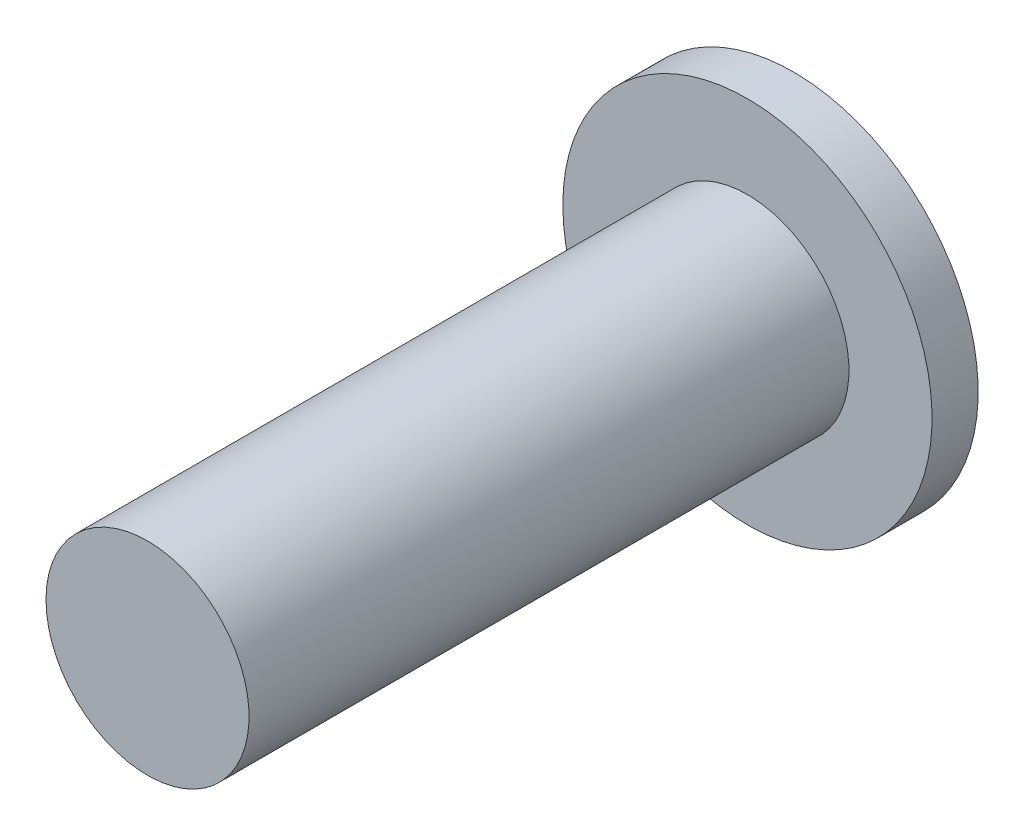
ISO-10303-21;
HEADER;
FILE_DESCRIPTION(('STEP AP214'),'2;1');
FILE_NAME('part.step','',(''),(''),'','','');
FILE_SCHEMA(('AUTOMOTIVE_DESIGN { 1 0 10303 214 1 1 1 1 }'));
ENDSEC;
DATA;
#1=APPLICATION_CONTEXT('core data for automotive mechanical design processes');
#2=APPLICATION_PROTOCOL_DEFINITION('international standard','automotive_design',2000,#1);
#3=PRODUCT_CONTEXT('',#1,'mechanical');
#4=PRODUCT('Part','Part','',(#3));
#5=PRODUCT_RELATED_PRODUCT_CATEGORY('part','',(#4));
#6=PRODUCT_DEFINITION_FORMATION('','',#4);
#7=PRODUCT_DEFINITION_CONTEXT('part definition',#1,'design');
#8=PRODUCT_DEFINITION('design','',#6,#7);
#9=PRODUCT_DEFINITION_SHAPE('','',#8);
#10=(LENGTH_UNIT() NAMED_UNIT(*) SI_UNIT(.MILLI.,.METRE.));
#11=(NAMED_UNIT(*) PLANE_ANGLE_UNIT() SI_UNIT($,.RADIAN.));
#12=(NAMED_UNIT(*) SI_UNIT($,.STERADIAN.) SOLID_ANGLE_UNIT());
#13=UNCERTAINTY_MEASURE_WITH_UNIT(LENGTH_MEASURE(1.E-05),#10,'distance_accuracy_value','');
#14=(GEOMETRIC_REPRESENTATION_CONTEXT(3) GLOBAL_UNCERTAINTY_ASSIGNED_CONTEXT((#13)) GLOBAL_UNIT_ASSIGNED_CONTEXT((#10,
#11,#12)) REPRESENTATION_CONTEXT('',''));
#15=CARTESIAN_POINT('',(0.,0.,0.));
#16=DIRECTION('',(0.,0.,1.));
#17=DIRECTION('',(1.,0.,0.));
#18=AXIS2_PLACEMENT_3D('',#15,#16,#17);
#19=CARTESIAN_POINT('',(0.,0.,0.));
#20=DIRECTION('',(0.,0.,1.));
#21=DIRECTION('',(1.,0.,0.));
#22=AXIS2_PLACEMENT_3D('',#19,#20,#21);
#23=PLANE('',#22);
#24=CARTESIAN_POINT('',(0.,0.,0.));
#25=DIRECTION('',(0.,0.,1.));
#26=DIRECTION('',(1.,0.,0.));
#27=AXIS2_PLACEMENT_3D('',#24,#25,#26);
#28=CIRCLE('',#27,2.2);
#29=CARTESIAN_POINT('',(-2.2,0.,0.));
#30=VERTEX_POINT('',#29);
#31=EDGE_CURVE('E111',#30,#30,#28,.T.);
#32=ORIENTED_EDGE('',*,*,#31,.F.);
#33=EDGE_LOOP('',(#32));
#34=FACE_BOUND('',#33,.T.);
#35=CARTESIAN_POINT('',(0.,0.,0.));
#36=DIRECTION('',(0.,0.,1.));
#37=DIRECTION('',(1.,0.,0.));
#38=AXIS2_PLACEMENT_3D('',#35,#36,#37);
#39=CIRCLE('',#38,4.);
#40=CARTESIAN_POINT('',(-4.,0.,0.));
#41=VERTEX_POINT('',#40);
#42=EDGE_CURVE('E11',#41,#41,#39,.T.);
#43=ORIENTED_EDGE('',*,*,#42,.T.);
#44=EDGE_LOOP('',(#43));
#45=FACE_BOUND('',#44,.T.);
#46=ADVANCED_FACE('F16',(#34,#45),#23,.T.);
#47=CARTESIAN_POINT('',(0.,0.,-1.));
#48=DIRECTION('',(0.,0.,1.));
#49=DIRECTION('',(1.,0.,0.));
#50=AXIS2_PLACEMENT_3D('',#47,#48,#49);
#51=PLANE('',#50);
#52=DIRECTION('',(0.,1.,0.));
#53=VECTOR('',#52,1.);
#54=CARTESIAN_POINT('',(-0.775906475947883,-0.398152632129984,-1.));
#55=LINE('',#54,#53);
#56=CARTESIAN_POINT('',(-0.775906475947883,-0.796305264259968,-1.));
#57=VERTEX_POINT('',#56);
#58=CARTESIAN_POINT('',(-0.775906475947883,0.796305264259968,-1.));
#59=VERTEX_POINT('',#58);
#60=EDGE_CURVE('E78',#57,#59,#55,.T.);
#61=ORIENTED_EDGE('',*,*,#60,.F.);
#62=DIRECTION('',(-1.,0.,0.));
#63=VECTOR('',#62,1.);
#64=CARTESIAN_POINT('',(0.387953237973941,-0.796305264259968,-1.));
#65=LINE('',#64,#63);
#66=CARTESIAN_POINT('',(0.775906475947883,-0.796305264259968,-1.));
#67=VERTEX_POINT('',#66);
#68=EDGE_CURVE('E123',#67,#57,#65,.T.);
#69=ORIENTED_EDGE('',*,*,#68,.F.);
#70=DIRECTION('',(0.,-1.,0.));
#71=VECTOR('',#70,1.);
#72=CARTESIAN_POINT('',(0.775906475947883,0.398152632129984,-1.));
#73=LINE('',#72,#71);
#74=CARTESIAN_POINT('',(0.775906475947883,0.796305264259968,-1.));
#75=VERTEX_POINT('',#74);
#76=EDGE_CURVE('E20',#75,#67,#73,.T.);
#77=ORIENTED_EDGE('',*,*,#76,.F.);
#78=DIRECTION('',(1.,0.,0.));
#79=VECTOR('',#78,1.);
#80=CARTESIAN_POINT('',(-0.387953237973941,0.796305264259968,-1.));
#81=LINE('',#80,#79);
#82=EDGE_CURVE('E73',#59,#75,#81,.T.);
#83=ORIENTED_EDGE('',*,*,#82,.F.);
#84=EDGE_LOOP('',(#61,#69,#77,#83));
#85=FACE_BOUND('',#84,.T.);
#86=CARTESIAN_POINT('',(0.,0.,-1.));
#87=DIRECTION('',(0.,0.,1.));
#88=DIRECTION('',(1.,0.,0.));
#89=AXIS2_PLACEMENT_3D('',#86,#87,#88);
#90=CIRCLE('',#89,4.);
#91=CARTESIAN_POINT('',(-4.,0.,-1.));
#92=VERTEX_POINT('',#91);
#93=EDGE_CURVE('E112',#92,#92,#90,.T.);
#94=ORIENTED_EDGE('',*,*,#93,.F.);
#95=EDGE_LOOP('',(#94));
#96=FACE_BOUND('',#95,.T.);
#97=ADVANCED_FACE('F74',(#85,#96),#51,.F.);
#98=CARTESIAN_POINT('',(0.,0.,0.));
#99=DIRECTION('',(0.,0.,1.));
#100=DIRECTION('',(1.,0.,0.));
#101=AXIS2_PLACEMENT_3D('',#98,#99,#100);
#102=CYLINDRICAL_SURFACE('',#101,4.);
#103=ORIENTED_EDGE('',*,*,#93,.T.);
#104=DIRECTION('',(0.,0.,1.));
#105=VECTOR('',#104,1.);
#106=CARTESIAN_POINT('',(-4.,0.,0.));
#107=LINE('',#106,#105);
#108=EDGE_CURVE('E27',#92,#41,#107,.T.);
#109=ORIENTED_EDGE('',*,*,#108,.T.);
#110=ORIENTED_EDGE('',*,*,#42,.F.);
#111=ORIENTED_EDGE('',*,*,#108,.F.);
#112=EDGE_LOOP('',(#103,#109,#110,#111));
#113=FACE_BOUND('',#112,.T.);
#114=ADVANCED_FACE('F18',(#113),#102,.T.);
#115=CARTESIAN_POINT('',(0.,0.,0.));
#116=DIRECTION('',(0.,0.,-1.));
#117=DIRECTION('',(1.,0.,0.));
#118=AXIS2_PLACEMENT_3D('',#115,#116,#117);
#119=CYLINDRICAL_SURFACE('',#118,2.2);
#120=CARTESIAN_POINT('',(0.,0.,13.));
#121=DIRECTION('',(0.,0.,-1.));
#122=DIRECTION('',(1.,0.,0.));
#123=AXIS2_PLACEMENT_3D('',#120,#121,#122);
#124=CIRCLE('',#123,2.2);
#125=CARTESIAN_POINT('',(-2.2,0.,13.));
#126=VERTEX_POINT('',#125);
#127=EDGE_CURVE('E98',#126,#126,#124,.T.);
#128=ORIENTED_EDGE('',*,*,#127,.T.);
#129=DIRECTION('',(0.,0.,-1.));
#130=VECTOR('',#129,1.);
#131=CARTESIAN_POINT('',(-2.2,0.,0.));
#132=LINE('',#131,#130);
#133=EDGE_CURVE('E107',#126,#30,#132,.T.);
#134=ORIENTED_EDGE('',*,*,#133,.T.);
#135=ORIENTED_EDGE('',*,*,#31,.T.);
#136=ORIENTED_EDGE('',*,*,#133,.F.);
#137=EDGE_LOOP('',(#128,#134,#135,#136));
#138=FACE_BOUND('',#137,.T.);
#139=ADVANCED_FACE('F146',(#138),#119,.T.);
#140=CARTESIAN_POINT('',(0.,0.,-0.5));
#141=DIRECTION('',(0.,0.,-1.));
#142=DIRECTION('',(0.,-1.,0.));
#143=AXIS2_PLACEMENT_3D('',#140,#141,#142);
#144=PLANE('',#143);
#145=DIRECTION('',(1.,0.,0.));
#146=VECTOR('',#145,1.);
#147=CARTESIAN_POINT('',(-0.775906475947883,0.796305264259968,-0.5));
#148=LINE('',#147,#146);
#149=CARTESIAN_POINT('',(-0.775906475947883,0.796305264259968,-0.5));
#150=VERTEX_POINT('',#149);
#151=CARTESIAN_POINT('',(0.775906475947883,0.796305264259968,-0.5));
#152=VERTEX_POINT('',#151);
#153=EDGE_CURVE('E62',#150,#152,#148,.T.);
#154=ORIENTED_EDGE('',*,*,#153,.T.);
#155=DIRECTION('',(0.,-1.,0.));
#156=VECTOR('',#155,1.);
#157=CARTESIAN_POINT('',(0.775906475947883,0.796305264259968,-0.5));
#158=LINE('',#157,#156);
#159=CARTESIAN_POINT('',(0.775906475947883,-0.796305264259968,-0.5));
#160=VERTEX_POINT('',#159);
#161=EDGE_CURVE('E133',#152,#160,#158,.T.);
#162=ORIENTED_EDGE('',*,*,#161,.T.);
#163=DIRECTION('',(-1.,0.,0.));
#164=VECTOR('',#163,1.);
#165=CARTESIAN_POINT('',(0.775906475947883,-0.796305264259968,-0.5));
#166=LINE('',#165,#164);
#167=CARTESIAN_POINT('',(-0.775906475947883,-0.796305264259968,-0.5));
#168=VERTEX_POINT('',#167);
#169=EDGE_CURVE('E124',#160,#168,#166,.T.);
#170=ORIENTED_EDGE('',*,*,#169,.T.);
#171=DIRECTION('',(0.,1.,0.));
#172=VECTOR('',#171,1.);
#173=CARTESIAN_POINT('',(-0.775906475947883,-0.796305264259968,-0.5));
#174=LINE('',#173,#172);
#175=EDGE_CURVE('E91',#168,#150,#174,.T.);
#176=ORIENTED_EDGE('',*,*,#175,.T.);
#177=EDGE_LOOP('',(#154,#162,#170,#176));
#178=FACE_BOUND('',#177,.T.);
#179=ADVANCED_FACE('F163',(#178),#144,.T.);
#180=CARTESIAN_POINT('',(-0.775906475947883,0.796305264259968,-1.));
#181=DIRECTION('',(0.,-1.,0.));
#182=DIRECTION('',(0.,0.,-1.));
#183=AXIS2_PLACEMENT_3D('',#180,#181,#182);
#184=PLANE('',#183);
#185=ORIENTED_EDGE('',*,*,#82,.T.);
#186=DIRECTION('',(0.,0.,1.));
#187=VECTOR('',#186,1.);
#188=CARTESIAN_POINT('',(0.775906475947883,0.796305264259968,-1.));
#189=LINE('',#188,#187);
#190=EDGE_CURVE('E83',#75,#152,#189,.T.);
#191=ORIENTED_EDGE('',*,*,#190,.T.);
#192=ORIENTED_EDGE('',*,*,#153,.F.);
#193=DIRECTION('',(0.,0.,1.));
#194=VECTOR('',#193,1.);
#195=CARTESIAN_POINT('',(-0.775906475947883,0.796305264259968,-1.));
#196=LINE('',#195,#194);
#197=EDGE_CURVE('E86',#59,#150,#196,.T.);
#198=ORIENTED_EDGE('',*,*,#197,.F.);
#199=EDGE_LOOP('',(#185,#191,#192,#198));
#200=FACE_BOUND('',#199,.T.);
#201=ADVANCED_FACE('F87',(#200),#184,.T.);
#202=CARTESIAN_POINT('',(0.775906475947883,0.796305264259968,-1.));
#203=DIRECTION('',(-1.,0.,0.));
#204=DIRECTION('',(0.,0.,1.));
#205=AXIS2_PLACEMENT_3D('',#202,#203,#204);
#206=PLANE('',#205);
#207=ORIENTED_EDGE('',*,*,#76,.T.);
#208=DIRECTION('',(0.,0.,1.));
#209=VECTOR('',#208,1.);
#210=CARTESIAN_POINT('',(0.775906475947883,-0.796305264259968,-1.));
#211=LINE('',#210,#209);
#212=EDGE_CURVE('E127',#67,#160,#211,.T.);
#213=ORIENTED_EDGE('',*,*,#212,.T.);
#214=ORIENTED_EDGE('',*,*,#161,.F.);
#215=ORIENTED_EDGE('',*,*,#190,.F.);
#216=EDGE_LOOP('',(#207,#213,#214,#215));
#217=FACE_BOUND('',#216,.T.);
#218=ADVANCED_FACE('F161',(#217),#206,.T.);
#219=CARTESIAN_POINT('',(0.775906475947883,-0.796305264259968,-1.));
#220=DIRECTION('',(0.,1.,0.));
#221=DIRECTION('',(1.,0.,0.));
#222=AXIS2_PLACEMENT_3D('',#219,#220,#221);
#223=PLANE('',#222);
#224=ORIENTED_EDGE('',*,*,#68,.T.);
#225=DIRECTION('',(0.,0.,1.));
#226=VECTOR('',#225,1.);
#227=CARTESIAN_POINT('',(-0.775906475947883,-0.796305264259968,-1.));
#228=LINE('',#227,#226);
#229=EDGE_CURVE('E96',#57,#168,#228,.T.);
#230=ORIENTED_EDGE('',*,*,#229,.T.);
#231=ORIENTED_EDGE('',*,*,#169,.F.);
#232=ORIENTED_EDGE('',*,*,#212,.F.);
#233=EDGE_LOOP('',(#224,#230,#231,#232));
#234=FACE_BOUND('',#233,.T.);
#235=ADVANCED_FACE('F158',(#234),#223,.T.);
#236=CARTESIAN_POINT('',(-0.775906475947883,-0.796305264259968,-1.));
#237=DIRECTION('',(1.,0.,0.));
#238=DIRECTION('',(0.,1.,0.));
#239=AXIS2_PLACEMENT_3D('',#236,#237,#238);
#240=PLANE('',#239);
#241=ORIENTED_EDGE('',*,*,#60,.T.);
#242=ORIENTED_EDGE('',*,*,#197,.T.);
#243=ORIENTED_EDGE('',*,*,#175,.F.);
#244=ORIENTED_EDGE('',*,*,#229,.F.);
#245=EDGE_LOOP('',(#241,#242,#243,#244));
#246=FACE_BOUND('',#245,.T.);
#247=ADVANCED_FACE('F94',(#246),#240,.T.);
#248=CARTESIAN_POINT('',(0.,0.,13.));
#249=DIRECTION('',(0.,0.,1.));
#250=DIRECTION('',(1.,0.,0.));
#251=AXIS2_PLACEMENT_3D('',#248,#249,#250);
#252=PLANE('',#251);
#253=ORIENTED_EDGE('',*,*,#127,.F.);
#254=EDGE_LOOP('',(#253));
#255=FACE_BOUND('',#254,.T.);
#256=ADVANCED_FACE('F169',(#255),#252,.T.);
#257=CLOSED_SHELL('',(#46,#97,#114,#139,#179,#201,#218,#235,#247,#256));
#258=MANIFOLD_SOLID_BREP('B1',#257);
#259=ADVANCED_BREP_SHAPE_REPRESENTATION('',(#18,#258),#14);
#260=SHAPE_DEFINITION_REPRESENTATION(#9,#259);
ENDSEC;
END-ISO-10303-21;
